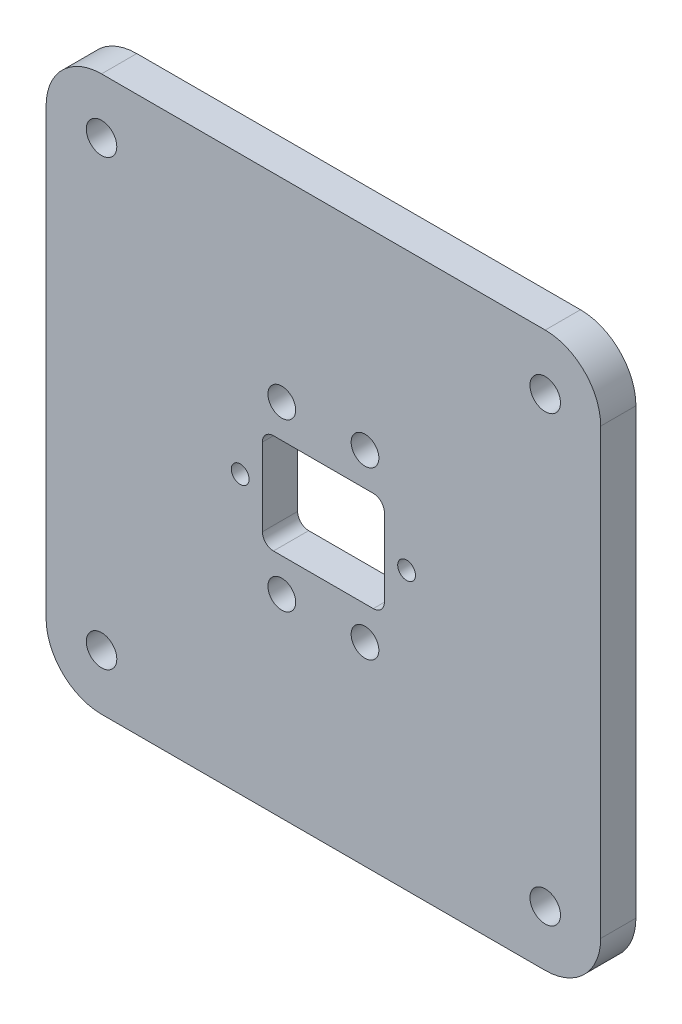
ISO-10303-21;
HEADER;
FILE_DESCRIPTION(('STEP AP214'),'2;1');
FILE_NAME('part.step','',(''),(''),'','','');
FILE_SCHEMA(('AUTOMOTIVE_DESIGN { 1 0 10303 214 1 1 1 1 }'));
ENDSEC;
DATA;
#1=APPLICATION_CONTEXT('core data for automotive mechanical design processes');
#2=APPLICATION_PROTOCOL_DEFINITION('international standard','automotive_design',2000,#1);
#3=PRODUCT_CONTEXT('',#1,'mechanical');
#4=PRODUCT('Part','Part','',(#3));
#5=PRODUCT_RELATED_PRODUCT_CATEGORY('part','',(#4));
#6=PRODUCT_DEFINITION_FORMATION('','',#4);
#7=PRODUCT_DEFINITION_CONTEXT('part definition',#1,'design');
#8=PRODUCT_DEFINITION('design','',#6,#7);
#9=PRODUCT_DEFINITION_SHAPE('','',#8);
#10=(LENGTH_UNIT() NAMED_UNIT(*) SI_UNIT(.MILLI.,.METRE.));
#11=(NAMED_UNIT(*) PLANE_ANGLE_UNIT() SI_UNIT($,.RADIAN.));
#12=(NAMED_UNIT(*) SI_UNIT($,.STERADIAN.) SOLID_ANGLE_UNIT());
#13=UNCERTAINTY_MEASURE_WITH_UNIT(LENGTH_MEASURE(1.E-05),#10,'distance_accuracy_value','');
#14=(GEOMETRIC_REPRESENTATION_CONTEXT(3) GLOBAL_UNCERTAINTY_ASSIGNED_CONTEXT((#13)) GLOBAL_UNIT_ASSIGNED_CONTEXT((#10,
#11,#12)) REPRESENTATION_CONTEXT('',''));
#15=CARTESIAN_POINT('',(0.,0.,0.));
#16=DIRECTION('',(0.,0.,1.));
#17=DIRECTION('',(1.,0.,0.));
#18=AXIS2_PLACEMENT_3D('',#15,#16,#17);
#19=CARTESIAN_POINT('',(40.,40.,6.35));
#20=DIRECTION('',(0.,0.,1.));
#21=DIRECTION('',(1.,0.,0.));
#22=AXIS2_PLACEMENT_3D('',#19,#20,#21);
#23=PLANE('',#22);
#24=CARTESIAN_POINT('',(-14.9999999999864,3.40474063403179E-12,6.35));
#25=DIRECTION('',(0.,0.,1.));
#26=DIRECTION('',(1.,0.,0.));
#27=AXIS2_PLACEMENT_3D('',#24,#25,#26);
#28=CIRCLE('',#27,1.59999999999901);
#29=CARTESIAN_POINT('',(-13.3999999999873,3.40474063403179E-12,6.35));
#30=VERTEX_POINT('',#29);
#31=EDGE_CURVE('E413',#30,#30,#28,.T.);
#32=ORIENTED_EDGE('',*,*,#31,.F.);
#33=EDGE_LOOP('',(#32));
#34=FACE_BOUND('',#33,.T.);
#35=CARTESIAN_POINT('',(7.50000000000001,-15.,6.35));
#36=DIRECTION('',(0.,0.,1.));
#37=DIRECTION('',(1.,0.,0.));
#38=AXIS2_PLACEMENT_3D('',#35,#36,#37);
#39=CIRCLE('',#38,2.5);
#40=CARTESIAN_POINT('',(10.,-15.,6.35));
#41=VERTEX_POINT('',#40);
#42=EDGE_CURVE('E425',#41,#41,#39,.T.);
#43=ORIENTED_EDGE('',*,*,#42,.F.);
#44=EDGE_LOOP('',(#43));
#45=FACE_BOUND('',#44,.T.);
#46=CARTESIAN_POINT('',(-7.49999999999999,15.,6.35));
#47=DIRECTION('',(0.,0.,1.));
#48=DIRECTION('',(1.,0.,0.));
#49=AXIS2_PLACEMENT_3D('',#46,#47,#48);
#50=CIRCLE('',#49,2.5);
#51=CARTESIAN_POINT('',(-4.99999999999999,15.,6.35));
#52=VERTEX_POINT('',#51);
#53=EDGE_CURVE('E437',#52,#52,#50,.T.);
#54=ORIENTED_EDGE('',*,*,#53,.F.);
#55=EDGE_LOOP('',(#54));
#56=FACE_BOUND('',#55,.T.);
#57=CARTESIAN_POINT('',(40.,-40.,6.35));
#58=DIRECTION('',(0.,0.,1.));
#59=DIRECTION('',(1.,0.,0.));
#60=AXIS2_PLACEMENT_3D('',#57,#58,#59);
#61=CIRCLE('',#60,2.75);
#62=CARTESIAN_POINT('',(42.75,-40.,6.35));
#63=VERTEX_POINT('',#62);
#64=EDGE_CURVE('E449',#63,#63,#61,.T.);
#65=ORIENTED_EDGE('',*,*,#64,.F.);
#66=EDGE_LOOP('',(#65));
#67=FACE_BOUND('',#66,.T.);
#68=CARTESIAN_POINT('',(-40.,40.,6.35));
#69=DIRECTION('',(0.,0.,1.));
#70=DIRECTION('',(1.,0.,0.));
#71=AXIS2_PLACEMENT_3D('',#68,#69,#70);
#72=CIRCLE('',#71,2.75);
#73=CARTESIAN_POINT('',(-37.25,40.,6.35));
#74=VERTEX_POINT('',#73);
#75=EDGE_CURVE('E184',#74,#74,#72,.T.);
#76=ORIENTED_EDGE('',*,*,#75,.F.);
#77=EDGE_LOOP('',(#76));
#78=FACE_BOUND('',#77,.T.);
#79=CARTESIAN_POINT('',(40.,40.,6.35));
#80=DIRECTION('',(0.,0.,1.));
#81=DIRECTION('',(1.,0.,0.));
#82=AXIS2_PLACEMENT_3D('',#79,#80,#81);
#83=CIRCLE('',#82,10.);
#84=CARTESIAN_POINT('',(50.,39.9999999999999,6.35));
#85=VERTEX_POINT('',#84);
#86=CARTESIAN_POINT('',(39.9999999999999,50.,6.35));
#87=VERTEX_POINT('',#86);
#88=EDGE_CURVE('E214',#85,#87,#83,.T.);
#89=ORIENTED_EDGE('',*,*,#88,.T.);
#90=DIRECTION('',(-1.,0.,0.));
#91=VECTOR('',#90,1.);
#92=CARTESIAN_POINT('',(39.9999999999999,50.,6.35));
#93=LINE('',#92,#91);
#94=CARTESIAN_POINT('',(-39.9999999999999,50.,6.35));
#95=VERTEX_POINT('',#94);
#96=EDGE_CURVE('E217',#87,#95,#93,.T.);
#97=ORIENTED_EDGE('',*,*,#96,.T.);
#98=CARTESIAN_POINT('',(-40.,40.,6.35));
#99=DIRECTION('',(0.,0.,1.));
#100=DIRECTION('',(1.,0.,0.));
#101=AXIS2_PLACEMENT_3D('',#98,#99,#100);
#102=CIRCLE('',#101,9.99999999999999);
#103=CARTESIAN_POINT('',(-50.,39.9999999999999,6.35));
#104=VERTEX_POINT('',#103);
#105=EDGE_CURVE('E220',#95,#104,#102,.T.);
#106=ORIENTED_EDGE('',*,*,#105,.T.);
#107=DIRECTION('',(0.,-1.,0.));
#108=VECTOR('',#107,1.);
#109=CARTESIAN_POINT('',(-50.,-40.,6.35));
#110=LINE('',#109,#108);
#111=CARTESIAN_POINT('',(-50.,-40.,6.35));
#112=VERTEX_POINT('',#111);
#113=EDGE_CURVE('E222',#104,#112,#110,.T.);
#114=ORIENTED_EDGE('',*,*,#113,.T.);
#115=CARTESIAN_POINT('',(-40.,-40.,6.35));
#116=DIRECTION('',(0.,0.,1.));
#117=DIRECTION('',(1.,0.,0.));
#118=AXIS2_PLACEMENT_3D('',#115,#116,#117);
#119=CIRCLE('',#118,10.);
#120=CARTESIAN_POINT('',(-39.9999999999999,-50.,6.35));
#121=VERTEX_POINT('',#120);
#122=EDGE_CURVE('E224',#112,#121,#119,.T.);
#123=ORIENTED_EDGE('',*,*,#122,.T.);
#124=DIRECTION('',(1.,0.,0.));
#125=VECTOR('',#124,1.);
#126=CARTESIAN_POINT('',(39.9999999999999,-50.,6.35));
#127=LINE('',#126,#125);
#128=CARTESIAN_POINT('',(39.9999999999999,-50.,6.35));
#129=VERTEX_POINT('',#128);
#130=EDGE_CURVE('E226',#121,#129,#127,.T.);
#131=ORIENTED_EDGE('',*,*,#130,.T.);
#132=CARTESIAN_POINT('',(40.,-40.,6.35));
#133=DIRECTION('',(0.,0.,1.));
#134=DIRECTION('',(1.,0.,0.));
#135=AXIS2_PLACEMENT_3D('',#132,#133,#134);
#136=CIRCLE('',#135,10.);
#137=CARTESIAN_POINT('',(50.,-39.9999999999999,6.35));
#138=VERTEX_POINT('',#137);
#139=EDGE_CURVE('E228',#129,#138,#136,.T.);
#140=ORIENTED_EDGE('',*,*,#139,.T.);
#141=DIRECTION('',(0.,1.,0.));
#142=VECTOR('',#141,1.);
#143=CARTESIAN_POINT('',(50.,-39.9999999999999,6.35));
#144=LINE('',#143,#142);
#145=EDGE_CURVE('E230',#138,#85,#144,.T.);
#146=ORIENTED_EDGE('',*,*,#145,.T.);
#147=EDGE_LOOP('',(#89,#97,#106,#114,#123,#131,#140,#146));
#148=FACE_BOUND('',#147,.T.);
#149=DIRECTION('',(1.,0.,0.));
#150=VECTOR('',#149,1.);
#151=CARTESIAN_POINT('',(9.,-9.,6.35));
#152=LINE('',#151,#150);
#153=CARTESIAN_POINT('',(-9.,-9.,6.35));
#154=VERTEX_POINT('',#153);
#155=CARTESIAN_POINT('',(9.,-9.,6.35));
#156=VERTEX_POINT('',#155);
#157=EDGE_CURVE('E154',#154,#156,#152,.T.);
#158=ORIENTED_EDGE('',*,*,#157,.F.);
#159=CARTESIAN_POINT('',(-9.,-7.,6.35));
#160=DIRECTION('',(0.,0.,1.));
#161=DIRECTION('',(1.,0.,0.));
#162=AXIS2_PLACEMENT_3D('',#159,#160,#161);
#163=CIRCLE('',#162,2.);
#164=CARTESIAN_POINT('',(-11.,-7.,6.35));
#165=VERTEX_POINT('',#164);
#166=EDGE_CURVE('E146',#165,#154,#163,.T.);
#167=ORIENTED_EDGE('',*,*,#166,.F.);
#168=DIRECTION('',(0.,-1.,0.));
#169=VECTOR('',#168,1.);
#170=CARTESIAN_POINT('',(-11.,-7.,6.35));
#171=LINE('',#170,#169);
#172=CARTESIAN_POINT('',(-11.,7.,6.35));
#173=VERTEX_POINT('',#172);
#174=EDGE_CURVE('E181',#173,#165,#171,.T.);
#175=ORIENTED_EDGE('',*,*,#174,.F.);
#176=CARTESIAN_POINT('',(-9.,7.,6.35));
#177=DIRECTION('',(0.,0.,1.));
#178=DIRECTION('',(1.,0.,0.));
#179=AXIS2_PLACEMENT_3D('',#176,#177,#178);
#180=CIRCLE('',#179,2.);
#181=CARTESIAN_POINT('',(-9.,9.,6.35));
#182=VERTEX_POINT('',#181);
#183=EDGE_CURVE('E179',#182,#173,#180,.T.);
#184=ORIENTED_EDGE('',*,*,#183,.F.);
#185=DIRECTION('',(-1.,0.,0.));
#186=VECTOR('',#185,1.);
#187=CARTESIAN_POINT('',(9.,9.,6.35));
#188=LINE('',#187,#186);
#189=CARTESIAN_POINT('',(9.,9.,6.35));
#190=VERTEX_POINT('',#189);
#191=EDGE_CURVE('E177',#190,#182,#188,.T.);
#192=ORIENTED_EDGE('',*,*,#191,.F.);
#193=CARTESIAN_POINT('',(9.,7.,6.35));
#194=DIRECTION('',(0.,0.,1.));
#195=DIRECTION('',(1.,0.,0.));
#196=AXIS2_PLACEMENT_3D('',#193,#194,#195);
#197=CIRCLE('',#196,2.);
#198=CARTESIAN_POINT('',(11.,7.,6.35));
#199=VERTEX_POINT('',#198);
#200=EDGE_CURVE('E175',#199,#190,#197,.T.);
#201=ORIENTED_EDGE('',*,*,#200,.F.);
#202=DIRECTION('',(0.,1.,0.));
#203=VECTOR('',#202,1.);
#204=CARTESIAN_POINT('',(11.,-7.,6.35));
#205=LINE('',#204,#203);
#206=CARTESIAN_POINT('',(11.,-7.,6.35));
#207=VERTEX_POINT('',#206);
#208=EDGE_CURVE('E170',#207,#199,#205,.T.);
#209=ORIENTED_EDGE('',*,*,#208,.F.);
#210=CARTESIAN_POINT('',(9.,-7.,6.35));
#211=DIRECTION('',(0.,0.,1.));
#212=DIRECTION('',(1.,0.,0.));
#213=AXIS2_PLACEMENT_3D('',#210,#211,#212);
#214=CIRCLE('',#213,2.);
#215=EDGE_CURVE('E168',#156,#207,#214,.T.);
#216=ORIENTED_EDGE('',*,*,#215,.F.);
#217=EDGE_LOOP('',(#158,#167,#175,#184,#192,#201,#209,#216));
#218=FACE_BOUND('',#217,.T.);
#219=CARTESIAN_POINT('',(40.,40.,6.35));
#220=DIRECTION('',(0.,0.,1.));
#221=DIRECTION('',(1.,0.,0.));
#222=AXIS2_PLACEMENT_3D('',#219,#220,#221);
#223=CIRCLE('',#222,2.75);
#224=CARTESIAN_POINT('',(42.75,40.,6.35));
#225=VERTEX_POINT('',#224);
#226=EDGE_CURVE('E455',#225,#225,#223,.T.);
#227=ORIENTED_EDGE('',*,*,#226,.F.);
#228=EDGE_LOOP('',(#227));
#229=FACE_BOUND('',#228,.T.);
#230=CARTESIAN_POINT('',(-40.,-40.,6.35));
#231=DIRECTION('',(0.,0.,1.));
#232=DIRECTION('',(1.,0.,0.));
#233=AXIS2_PLACEMENT_3D('',#230,#231,#232);
#234=CIRCLE('',#233,2.75);
#235=CARTESIAN_POINT('',(-37.25,-40.,6.35));
#236=VERTEX_POINT('',#235);
#237=EDGE_CURVE('E443',#236,#236,#234,.T.);
#238=ORIENTED_EDGE('',*,*,#237,.F.);
#239=EDGE_LOOP('',(#238));
#240=FACE_BOUND('',#239,.T.);
#241=CARTESIAN_POINT('',(7.50000000000001,15.,6.35));
#242=DIRECTION('',(0.,0.,1.));
#243=DIRECTION('',(1.,0.,0.));
#244=AXIS2_PLACEMENT_3D('',#241,#242,#243);
#245=CIRCLE('',#244,2.5);
#246=CARTESIAN_POINT('',(10.,15.,6.35));
#247=VERTEX_POINT('',#246);
#248=EDGE_CURVE('E431',#247,#247,#245,.T.);
#249=ORIENTED_EDGE('',*,*,#248,.F.);
#250=EDGE_LOOP('',(#249));
#251=FACE_BOUND('',#250,.T.);
#252=CARTESIAN_POINT('',(-7.49999999999999,-15.,6.35));
#253=DIRECTION('',(0.,0.,1.));
#254=DIRECTION('',(1.,0.,0.));
#255=AXIS2_PLACEMENT_3D('',#252,#253,#254);
#256=CIRCLE('',#255,2.5);
#257=CARTESIAN_POINT('',(-4.99999999999999,-15.,6.35));
#258=VERTEX_POINT('',#257);
#259=EDGE_CURVE('E419',#258,#258,#256,.T.);
#260=ORIENTED_EDGE('',*,*,#259,.F.);
#261=EDGE_LOOP('',(#260));
#262=FACE_BOUND('',#261,.T.);
#263=CARTESIAN_POINT('',(14.9999999999864,3.40841457442923E-12,6.35));
#264=DIRECTION('',(0.,0.,1.));
#265=DIRECTION('',(1.,0.,0.));
#266=AXIS2_PLACEMENT_3D('',#263,#264,#265);
#267=CIRCLE('',#266,1.599999999999);
#268=CARTESIAN_POINT('',(16.5999999999854,3.40841457442923E-12,6.35));
#269=VERTEX_POINT('',#268);
#270=EDGE_CURVE('E404',#269,#269,#267,.T.);
#271=ORIENTED_EDGE('',*,*,#270,.F.);
#272=EDGE_LOOP('',(#271));
#273=FACE_BOUND('',#272,.T.);
#274=ADVANCED_FACE('F33',(#34,#45,#56,#67,#78,#148,#218,#229,#240,#251,#262,#273),#23,.T.);
#275=CARTESIAN_POINT('',(40.,40.,0.));
#276=DIRECTION('',(0.,0.,1.));
#277=DIRECTION('',(1.,0.,0.));
#278=AXIS2_PLACEMENT_3D('',#275,#276,#277);
#279=PLANE('',#278);
#280=CARTESIAN_POINT('',(-14.9999999999864,3.40474063403179E-12,0.));
#281=DIRECTION('',(0.,0.,1.));
#282=DIRECTION('',(1.,0.,0.));
#283=AXIS2_PLACEMENT_3D('',#280,#281,#282);
#284=CIRCLE('',#283,1.59999999999901);
#285=CARTESIAN_POINT('',(-13.3999999999873,3.40474063403179E-12,0.));
#286=VERTEX_POINT('',#285);
#287=EDGE_CURVE('E410',#286,#286,#284,.T.);
#288=ORIENTED_EDGE('',*,*,#287,.T.);
#289=EDGE_LOOP('',(#288));
#290=FACE_BOUND('',#289,.T.);
#291=CARTESIAN_POINT('',(7.50000000000001,-15.,0.));
#292=DIRECTION('',(0.,0.,1.));
#293=DIRECTION('',(1.,0.,0.));
#294=AXIS2_PLACEMENT_3D('',#291,#292,#293);
#295=CIRCLE('',#294,2.5);
#296=CARTESIAN_POINT('',(10.,-15.,0.));
#297=VERTEX_POINT('',#296);
#298=EDGE_CURVE('E422',#297,#297,#295,.T.);
#299=ORIENTED_EDGE('',*,*,#298,.T.);
#300=EDGE_LOOP('',(#299));
#301=FACE_BOUND('',#300,.T.);
#302=CARTESIAN_POINT('',(-7.49999999999999,15.,0.));
#303=DIRECTION('',(0.,0.,1.));
#304=DIRECTION('',(1.,0.,0.));
#305=AXIS2_PLACEMENT_3D('',#302,#303,#304);
#306=CIRCLE('',#305,2.5);
#307=CARTESIAN_POINT('',(-4.99999999999999,15.,0.));
#308=VERTEX_POINT('',#307);
#309=EDGE_CURVE('E434',#308,#308,#306,.T.);
#310=ORIENTED_EDGE('',*,*,#309,.T.);
#311=EDGE_LOOP('',(#310));
#312=FACE_BOUND('',#311,.T.);
#313=CARTESIAN_POINT('',(40.,-40.,0.));
#314=DIRECTION('',(0.,0.,1.));
#315=DIRECTION('',(1.,0.,0.));
#316=AXIS2_PLACEMENT_3D('',#313,#314,#315);
#317=CIRCLE('',#316,2.75);
#318=CARTESIAN_POINT('',(42.75,-40.,0.));
#319=VERTEX_POINT('',#318);
#320=EDGE_CURVE('E446',#319,#319,#317,.T.);
#321=ORIENTED_EDGE('',*,*,#320,.T.);
#322=EDGE_LOOP('',(#321));
#323=FACE_BOUND('',#322,.T.);
#324=CARTESIAN_POINT('',(-40.,40.,0.));
#325=DIRECTION('',(0.,0.,1.));
#326=DIRECTION('',(1.,0.,0.));
#327=AXIS2_PLACEMENT_3D('',#324,#325,#326);
#328=CIRCLE('',#327,2.75);
#329=CARTESIAN_POINT('',(-37.25,40.,0.));
#330=VERTEX_POINT('',#329);
#331=EDGE_CURVE('E458',#330,#330,#328,.T.);
#332=ORIENTED_EDGE('',*,*,#331,.T.);
#333=EDGE_LOOP('',(#332));
#334=FACE_BOUND('',#333,.T.);
#335=CARTESIAN_POINT('',(40.,40.,0.));
#336=DIRECTION('',(0.,0.,1.));
#337=DIRECTION('',(1.,0.,0.));
#338=AXIS2_PLACEMENT_3D('',#335,#336,#337);
#339=CIRCLE('',#338,10.);
#340=CARTESIAN_POINT('',(50.,39.9999999999999,0.));
#341=VERTEX_POINT('',#340);
#342=CARTESIAN_POINT('',(39.9999999999999,50.,0.));
#343=VERTEX_POINT('',#342);
#344=EDGE_CURVE('E162',#341,#343,#339,.T.);
#345=ORIENTED_EDGE('',*,*,#344,.F.);
#346=DIRECTION('',(0.,1.,0.));
#347=VECTOR('',#346,1.);
#348=CARTESIAN_POINT('',(50.,-39.9999999999999,0.));
#349=LINE('',#348,#347);
#350=CARTESIAN_POINT('',(50.,-39.9999999999999,0.));
#351=VERTEX_POINT('',#350);
#352=EDGE_CURVE('E218',#351,#341,#349,.T.);
#353=ORIENTED_EDGE('',*,*,#352,.F.);
#354=CARTESIAN_POINT('',(40.,-40.,0.));
#355=DIRECTION('',(0.,0.,1.));
#356=DIRECTION('',(1.,0.,0.));
#357=AXIS2_PLACEMENT_3D('',#354,#355,#356);
#358=CIRCLE('',#357,10.);
#359=CARTESIAN_POINT('',(39.9999999999999,-50.,0.));
#360=VERTEX_POINT('',#359);
#361=EDGE_CURVE('E245',#360,#351,#358,.T.);
#362=ORIENTED_EDGE('',*,*,#361,.F.);
#363=DIRECTION('',(1.,0.,0.));
#364=VECTOR('',#363,1.);
#365=CARTESIAN_POINT('',(39.9999999999999,-50.,0.));
#366=LINE('',#365,#364);
#367=CARTESIAN_POINT('',(-39.9999999999999,-50.,0.));
#368=VERTEX_POINT('',#367);
#369=EDGE_CURVE('E243',#368,#360,#366,.T.);
#370=ORIENTED_EDGE('',*,*,#369,.F.);
#371=CARTESIAN_POINT('',(-40.,-40.,0.));
#372=DIRECTION('',(0.,0.,1.));
#373=DIRECTION('',(1.,0.,0.));
#374=AXIS2_PLACEMENT_3D('',#371,#372,#373);
#375=CIRCLE('',#374,10.);
#376=CARTESIAN_POINT('',(-50.,-40.,0.));
#377=VERTEX_POINT('',#376);
#378=EDGE_CURVE('E241',#377,#368,#375,.T.);
#379=ORIENTED_EDGE('',*,*,#378,.F.);
#380=DIRECTION('',(0.,-1.,0.));
#381=VECTOR('',#380,1.);
#382=CARTESIAN_POINT('',(-50.,-40.,0.));
#383=LINE('',#382,#381);
#384=CARTESIAN_POINT('',(-50.,39.9999999999999,0.));
#385=VERTEX_POINT('',#384);
#386=EDGE_CURVE('E239',#385,#377,#383,.T.);
#387=ORIENTED_EDGE('',*,*,#386,.F.);
#388=CARTESIAN_POINT('',(-40.,40.,0.));
#389=DIRECTION('',(0.,0.,1.));
#390=DIRECTION('',(1.,0.,0.));
#391=AXIS2_PLACEMENT_3D('',#388,#389,#390);
#392=CIRCLE('',#391,9.99999999999999);
#393=CARTESIAN_POINT('',(-39.9999999999999,50.,0.));
#394=VERTEX_POINT('',#393);
#395=EDGE_CURVE('E237',#394,#385,#392,.T.);
#396=ORIENTED_EDGE('',*,*,#395,.F.);
#397=DIRECTION('',(-1.,0.,0.));
#398=VECTOR('',#397,1.);
#399=CARTESIAN_POINT('',(39.9999999999999,50.,0.));
#400=LINE('',#399,#398);
#401=EDGE_CURVE('E235',#343,#394,#400,.T.);
#402=ORIENTED_EDGE('',*,*,#401,.F.);
#403=EDGE_LOOP('',(#345,#353,#362,#370,#379,#387,#396,#402));
#404=FACE_BOUND('',#403,.T.);
#405=CARTESIAN_POINT('',(-9.,-7.,0.));
#406=DIRECTION('',(0.,0.,1.));
#407=DIRECTION('',(1.,0.,0.));
#408=AXIS2_PLACEMENT_3D('',#405,#406,#407);
#409=CIRCLE('',#408,2.);
#410=CARTESIAN_POINT('',(-11.,-7.,0.));
#411=VERTEX_POINT('',#410);
#412=CARTESIAN_POINT('',(-9.,-9.,0.));
#413=VERTEX_POINT('',#412);
#414=EDGE_CURVE('E56',#411,#413,#409,.T.);
#415=ORIENTED_EDGE('',*,*,#414,.T.);
#416=DIRECTION('',(1.,0.,0.));
#417=VECTOR('',#416,1.);
#418=CARTESIAN_POINT('',(9.,-9.,0.));
#419=LINE('',#418,#417);
#420=CARTESIAN_POINT('',(9.,-9.,0.));
#421=VERTEX_POINT('',#420);
#422=EDGE_CURVE('E161',#413,#421,#419,.T.);
#423=ORIENTED_EDGE('',*,*,#422,.T.);
#424=CARTESIAN_POINT('',(9.,-7.,0.));
#425=DIRECTION('',(0.,0.,1.));
#426=DIRECTION('',(1.,0.,0.));
#427=AXIS2_PLACEMENT_3D('',#424,#425,#426);
#428=CIRCLE('',#427,2.);
#429=CARTESIAN_POINT('',(11.,-7.,0.));
#430=VERTEX_POINT('',#429);
#431=EDGE_CURVE('E186',#421,#430,#428,.T.);
#432=ORIENTED_EDGE('',*,*,#431,.T.);
#433=DIRECTION('',(0.,1.,0.));
#434=VECTOR('',#433,1.);
#435=CARTESIAN_POINT('',(11.,-7.,0.));
#436=LINE('',#435,#434);
#437=CARTESIAN_POINT('',(11.,7.,0.));
#438=VERTEX_POINT('',#437);
#439=EDGE_CURVE('E189',#430,#438,#436,.T.);
#440=ORIENTED_EDGE('',*,*,#439,.T.);
#441=CARTESIAN_POINT('',(9.,7.,0.));
#442=DIRECTION('',(0.,0.,1.));
#443=DIRECTION('',(1.,0.,0.));
#444=AXIS2_PLACEMENT_3D('',#441,#442,#443);
#445=CIRCLE('',#444,2.);
#446=CARTESIAN_POINT('',(9.,9.,0.));
#447=VERTEX_POINT('',#446);
#448=EDGE_CURVE('E192',#438,#447,#445,.T.);
#449=ORIENTED_EDGE('',*,*,#448,.T.);
#450=DIRECTION('',(-1.,0.,0.));
#451=VECTOR('',#450,1.);
#452=CARTESIAN_POINT('',(9.,9.,0.));
#453=LINE('',#452,#451);
#454=CARTESIAN_POINT('',(-9.,9.,0.));
#455=VERTEX_POINT('',#454);
#456=EDGE_CURVE('E195',#447,#455,#453,.T.);
#457=ORIENTED_EDGE('',*,*,#456,.T.);
#458=CARTESIAN_POINT('',(-9.,7.,0.));
#459=DIRECTION('',(0.,0.,1.));
#460=DIRECTION('',(1.,0.,0.));
#461=AXIS2_PLACEMENT_3D('',#458,#459,#460);
#462=CIRCLE('',#461,2.);
#463=CARTESIAN_POINT('',(-11.,7.,0.));
#464=VERTEX_POINT('',#463);
#465=EDGE_CURVE('E198',#455,#464,#462,.T.);
#466=ORIENTED_EDGE('',*,*,#465,.T.);
#467=DIRECTION('',(0.,-1.,0.));
#468=VECTOR('',#467,1.);
#469=CARTESIAN_POINT('',(-11.,-7.,0.));
#470=LINE('',#469,#468);
#471=EDGE_CURVE('E155',#464,#411,#470,.T.);
#472=ORIENTED_EDGE('',*,*,#471,.T.);
#473=EDGE_LOOP('',(#415,#423,#432,#440,#449,#457,#466,#472));
#474=FACE_BOUND('',#473,.T.);
#475=CARTESIAN_POINT('',(40.,40.,0.));
#476=DIRECTION('',(0.,0.,1.));
#477=DIRECTION('',(1.,0.,0.));
#478=AXIS2_PLACEMENT_3D('',#475,#476,#477);
#479=CIRCLE('',#478,2.75);
#480=CARTESIAN_POINT('',(42.75,40.,0.));
#481=VERTEX_POINT('',#480);
#482=EDGE_CURVE('E452',#481,#481,#479,.T.);
#483=ORIENTED_EDGE('',*,*,#482,.T.);
#484=EDGE_LOOP('',(#483));
#485=FACE_BOUND('',#484,.T.);
#486=CARTESIAN_POINT('',(-40.,-40.,0.));
#487=DIRECTION('',(0.,0.,1.));
#488=DIRECTION('',(1.,0.,0.));
#489=AXIS2_PLACEMENT_3D('',#486,#487,#488);
#490=CIRCLE('',#489,2.75);
#491=CARTESIAN_POINT('',(-37.25,-40.,0.));
#492=VERTEX_POINT('',#491);
#493=EDGE_CURVE('E440',#492,#492,#490,.T.);
#494=ORIENTED_EDGE('',*,*,#493,.T.);
#495=EDGE_LOOP('',(#494));
#496=FACE_BOUND('',#495,.T.);
#497=CARTESIAN_POINT('',(7.50000000000001,15.,0.));
#498=DIRECTION('',(0.,0.,1.));
#499=DIRECTION('',(1.,0.,0.));
#500=AXIS2_PLACEMENT_3D('',#497,#498,#499);
#501=CIRCLE('',#500,2.5);
#502=CARTESIAN_POINT('',(10.,15.,0.));
#503=VERTEX_POINT('',#502);
#504=EDGE_CURVE('E428',#503,#503,#501,.T.);
#505=ORIENTED_EDGE('',*,*,#504,.T.);
#506=EDGE_LOOP('',(#505));
#507=FACE_BOUND('',#506,.T.);
#508=CARTESIAN_POINT('',(-7.49999999999999,-15.,0.));
#509=DIRECTION('',(0.,0.,1.));
#510=DIRECTION('',(1.,0.,0.));
#511=AXIS2_PLACEMENT_3D('',#508,#509,#510);
#512=CIRCLE('',#511,2.5);
#513=CARTESIAN_POINT('',(-4.99999999999999,-15.,0.));
#514=VERTEX_POINT('',#513);
#515=EDGE_CURVE('E416',#514,#514,#512,.T.);
#516=ORIENTED_EDGE('',*,*,#515,.T.);
#517=EDGE_LOOP('',(#516));
#518=FACE_BOUND('',#517,.T.);
#519=CARTESIAN_POINT('',(14.9999999999864,3.40841457442923E-12,0.));
#520=DIRECTION('',(0.,0.,1.));
#521=DIRECTION('',(1.,0.,0.));
#522=AXIS2_PLACEMENT_3D('',#519,#520,#521);
#523=CIRCLE('',#522,1.599999999999);
#524=CARTESIAN_POINT('',(16.5999999999854,3.40841457442923E-12,0.));
#525=VERTEX_POINT('',#524);
#526=EDGE_CURVE('E407',#525,#525,#523,.T.);
#527=ORIENTED_EDGE('',*,*,#526,.T.);
#528=EDGE_LOOP('',(#527));
#529=FACE_BOUND('',#528,.T.);
#530=ADVANCED_FACE('F275',(#290,#301,#312,#323,#334,#404,#474,#485,#496,#507,#518,#529),#279,.F.);
#531=CARTESIAN_POINT('',(40.,40.,6.35));
#532=DIRECTION('',(0.,0.,-1.));
#533=DIRECTION('',(-1.,0.,0.));
#534=AXIS2_PLACEMENT_3D('',#531,#532,#533);
#535=CYLINDRICAL_SURFACE('',#534,10.);
#536=ORIENTED_EDGE('',*,*,#344,.T.);
#537=DIRECTION('',(0.,0.,-1.));
#538=VECTOR('',#537,1.);
#539=CARTESIAN_POINT('',(39.9999999999999,50.,6.35));
#540=LINE('',#539,#538);
#541=EDGE_CURVE('E11',#87,#343,#540,.T.);
#542=ORIENTED_EDGE('',*,*,#541,.F.);
#543=ORIENTED_EDGE('',*,*,#88,.F.);
#544=DIRECTION('',(0.,0.,-1.));
#545=VECTOR('',#544,1.);
#546=CARTESIAN_POINT('',(50.,39.9999999999999,6.35));
#547=LINE('',#546,#545);
#548=EDGE_CURVE('E232',#85,#341,#547,.T.);
#549=ORIENTED_EDGE('',*,*,#548,.T.);
#550=EDGE_LOOP('',(#536,#542,#543,#549));
#551=FACE_BOUND('',#550,.T.);
#552=ADVANCED_FACE('F35',(#551),#535,.T.);
#553=CARTESIAN_POINT('',(39.9999999999999,50.,6.35));
#554=DIRECTION('',(0.,-1.,0.));
#555=DIRECTION('',(1.,0.,0.));
#556=AXIS2_PLACEMENT_3D('',#553,#554,#555);
#557=PLANE('',#556);
#558=ORIENTED_EDGE('',*,*,#401,.T.);
#559=DIRECTION('',(0.,0.,-1.));
#560=VECTOR('',#559,1.);
#561=CARTESIAN_POINT('',(-39.9999999999999,50.,6.35));
#562=LINE('',#561,#560);
#563=EDGE_CURVE('E41',#95,#394,#562,.T.);
#564=ORIENTED_EDGE('',*,*,#563,.F.);
#565=ORIENTED_EDGE('',*,*,#96,.F.);
#566=ORIENTED_EDGE('',*,*,#541,.T.);
#567=EDGE_LOOP('',(#558,#564,#565,#566));
#568=FACE_BOUND('',#567,.T.);
#569=ADVANCED_FACE('F292',(#568),#557,.F.);
#570=CARTESIAN_POINT('',(-40.,40.,6.35));
#571=DIRECTION('',(0.,0.,-1.));
#572=DIRECTION('',(-1.,0.,0.));
#573=AXIS2_PLACEMENT_3D('',#570,#571,#572);
#574=CYLINDRICAL_SURFACE('',#573,9.99999999999999);
#575=ORIENTED_EDGE('',*,*,#395,.T.);
#576=DIRECTION('',(0.,0.,-1.));
#577=VECTOR('',#576,1.);
#578=CARTESIAN_POINT('',(-50.,39.9999999999999,6.35));
#579=LINE('',#578,#577);
#580=EDGE_CURVE('E262',#104,#385,#579,.T.);
#581=ORIENTED_EDGE('',*,*,#580,.F.);
#582=ORIENTED_EDGE('',*,*,#105,.F.);
#583=ORIENTED_EDGE('',*,*,#563,.T.);
#584=EDGE_LOOP('',(#575,#581,#582,#583));
#585=FACE_BOUND('',#584,.T.);
#586=ADVANCED_FACE('F269',(#585),#574,.T.);
#587=CARTESIAN_POINT('',(-50.,-40.,6.35));
#588=DIRECTION('',(1.,0.,0.));
#589=DIRECTION('',(0.,0.,-1.));
#590=AXIS2_PLACEMENT_3D('',#587,#588,#589);
#591=PLANE('',#590);
#592=ORIENTED_EDGE('',*,*,#386,.T.);
#593=DIRECTION('',(0.,0.,-1.));
#594=VECTOR('',#593,1.);
#595=CARTESIAN_POINT('',(-50.,-40.,6.35));
#596=LINE('',#595,#594);
#597=EDGE_CURVE('E259',#112,#377,#596,.T.);
#598=ORIENTED_EDGE('',*,*,#597,.F.);
#599=ORIENTED_EDGE('',*,*,#113,.F.);
#600=ORIENTED_EDGE('',*,*,#580,.T.);
#601=EDGE_LOOP('',(#592,#598,#599,#600));
#602=FACE_BOUND('',#601,.T.);
#603=ADVANCED_FACE('F281',(#602),#591,.F.);
#604=CARTESIAN_POINT('',(-40.,-40.,6.35));
#605=DIRECTION('',(0.,0.,-1.));
#606=DIRECTION('',(-1.,0.,0.));
#607=AXIS2_PLACEMENT_3D('',#604,#605,#606);
#608=CYLINDRICAL_SURFACE('',#607,10.);
#609=ORIENTED_EDGE('',*,*,#378,.T.);
#610=DIRECTION('',(0.,0.,-1.));
#611=VECTOR('',#610,1.);
#612=CARTESIAN_POINT('',(-39.9999999999999,-50.,6.35));
#613=LINE('',#612,#611);
#614=EDGE_CURVE('E256',#121,#368,#613,.T.);
#615=ORIENTED_EDGE('',*,*,#614,.F.);
#616=ORIENTED_EDGE('',*,*,#122,.F.);
#617=ORIENTED_EDGE('',*,*,#597,.T.);
#618=EDGE_LOOP('',(#609,#615,#616,#617));
#619=FACE_BOUND('',#618,.T.);
#620=ADVANCED_FACE('F285',(#619),#608,.T.);
#621=CARTESIAN_POINT('',(39.9999999999999,-50.,6.35));
#622=DIRECTION('',(0.,1.,0.));
#623=DIRECTION('',(-1.,0.,0.));
#624=AXIS2_PLACEMENT_3D('',#621,#622,#623);
#625=PLANE('',#624);
#626=ORIENTED_EDGE('',*,*,#369,.T.);
#627=DIRECTION('',(0.,0.,-1.));
#628=VECTOR('',#627,1.);
#629=CARTESIAN_POINT('',(39.9999999999999,-50.,6.35));
#630=LINE('',#629,#628);
#631=EDGE_CURVE('E253',#129,#360,#630,.T.);
#632=ORIENTED_EDGE('',*,*,#631,.F.);
#633=ORIENTED_EDGE('',*,*,#130,.F.);
#634=ORIENTED_EDGE('',*,*,#614,.T.);
#635=EDGE_LOOP('',(#626,#632,#633,#634));
#636=FACE_BOUND('',#635,.T.);
#637=ADVANCED_FACE('F305',(#636),#625,.F.);
#638=CARTESIAN_POINT('',(40.,-40.,6.35));
#639=DIRECTION('',(0.,0.,-1.));
#640=DIRECTION('',(-1.,0.,0.));
#641=AXIS2_PLACEMENT_3D('',#638,#639,#640);
#642=CYLINDRICAL_SURFACE('',#641,10.);
#643=ORIENTED_EDGE('',*,*,#361,.T.);
#644=DIRECTION('',(0.,0.,-1.));
#645=VECTOR('',#644,1.);
#646=CARTESIAN_POINT('',(50.,-39.9999999999999,6.35));
#647=LINE('',#646,#645);
#648=EDGE_CURVE('E250',#138,#351,#647,.T.);
#649=ORIENTED_EDGE('',*,*,#648,.F.);
#650=ORIENTED_EDGE('',*,*,#139,.F.);
#651=ORIENTED_EDGE('',*,*,#631,.T.);
#652=EDGE_LOOP('',(#643,#649,#650,#651));
#653=FACE_BOUND('',#652,.T.);
#654=ADVANCED_FACE('F303',(#653),#642,.T.);
#655=CARTESIAN_POINT('',(50.,-39.9999999999999,6.35));
#656=DIRECTION('',(-1.,0.,0.));
#657=DIRECTION('',(0.,0.,1.));
#658=AXIS2_PLACEMENT_3D('',#655,#656,#657);
#659=PLANE('',#658);
#660=ORIENTED_EDGE('',*,*,#352,.T.);
#661=ORIENTED_EDGE('',*,*,#548,.F.);
#662=ORIENTED_EDGE('',*,*,#145,.F.);
#663=ORIENTED_EDGE('',*,*,#648,.T.);
#664=EDGE_LOOP('',(#660,#661,#662,#663));
#665=FACE_BOUND('',#664,.T.);
#666=ADVANCED_FACE('F298',(#665),#659,.F.);
#667=CARTESIAN_POINT('',(-9.,-7.,6.35));
#668=DIRECTION('',(0.,0.,-1.));
#669=DIRECTION('',(-1.,0.,0.));
#670=AXIS2_PLACEMENT_3D('',#667,#668,#669);
#671=CYLINDRICAL_SURFACE('',#670,2.);
#672=ORIENTED_EDGE('',*,*,#414,.F.);
#673=DIRECTION('',(0.,0.,-1.));
#674=VECTOR('',#673,1.);
#675=CARTESIAN_POINT('',(-11.,-7.,6.35));
#676=LINE('',#675,#674);
#677=EDGE_CURVE('E150',#165,#411,#676,.T.);
#678=ORIENTED_EDGE('',*,*,#677,.F.);
#679=ORIENTED_EDGE('',*,*,#166,.T.);
#680=DIRECTION('',(0.,0.,-1.));
#681=VECTOR('',#680,1.);
#682=CARTESIAN_POINT('',(-9.,-9.,6.35));
#683=LINE('',#682,#681);
#684=EDGE_CURVE('E149',#154,#413,#683,.T.);
#685=ORIENTED_EDGE('',*,*,#684,.T.);
#686=EDGE_LOOP('',(#672,#678,#679,#685));
#687=FACE_BOUND('',#686,.T.);
#688=ADVANCED_FACE('F148',(#687),#671,.F.);
#689=CARTESIAN_POINT('',(9.,-9.,6.35));
#690=DIRECTION('',(0.,1.,0.));
#691=DIRECTION('',(-1.,0.,0.));
#692=AXIS2_PLACEMENT_3D('',#689,#690,#691);
#693=PLANE('',#692);
#694=ORIENTED_EDGE('',*,*,#422,.F.);
#695=ORIENTED_EDGE('',*,*,#684,.F.);
#696=ORIENTED_EDGE('',*,*,#157,.T.);
#697=DIRECTION('',(0.,0.,-1.));
#698=VECTOR('',#697,1.);
#699=CARTESIAN_POINT('',(9.,-9.,6.35));
#700=LINE('',#699,#698);
#701=EDGE_CURVE('E163',#156,#421,#700,.T.);
#702=ORIENTED_EDGE('',*,*,#701,.T.);
#703=EDGE_LOOP('',(#694,#695,#696,#702));
#704=FACE_BOUND('',#703,.T.);
#705=ADVANCED_FACE('F158',(#704),#693,.T.);
#706=CARTESIAN_POINT('',(9.,-7.,6.35));
#707=DIRECTION('',(0.,0.,-1.));
#708=DIRECTION('',(-1.,0.,0.));
#709=AXIS2_PLACEMENT_3D('',#706,#707,#708);
#710=CYLINDRICAL_SURFACE('',#709,2.);
#711=ORIENTED_EDGE('',*,*,#431,.F.);
#712=ORIENTED_EDGE('',*,*,#701,.F.);
#713=ORIENTED_EDGE('',*,*,#215,.T.);
#714=DIRECTION('',(0.,0.,-1.));
#715=VECTOR('',#714,1.);
#716=CARTESIAN_POINT('',(11.,-7.,6.35));
#717=LINE('',#716,#715);
#718=EDGE_CURVE('E211',#207,#430,#717,.T.);
#719=ORIENTED_EDGE('',*,*,#718,.T.);
#720=EDGE_LOOP('',(#711,#712,#713,#719));
#721=FACE_BOUND('',#720,.T.);
#722=ADVANCED_FACE('F334',(#721),#710,.F.);
#723=CARTESIAN_POINT('',(11.,-7.,6.35));
#724=DIRECTION('',(-1.,0.,0.));
#725=DIRECTION('',(0.,0.,1.));
#726=AXIS2_PLACEMENT_3D('',#723,#724,#725);
#727=PLANE('',#726);
#728=ORIENTED_EDGE('',*,*,#439,.F.);
#729=ORIENTED_EDGE('',*,*,#718,.F.);
#730=ORIENTED_EDGE('',*,*,#208,.T.);
#731=DIRECTION('',(0.,0.,-1.));
#732=VECTOR('',#731,1.);
#733=CARTESIAN_POINT('',(11.,7.,6.35));
#734=LINE('',#733,#732);
#735=EDGE_CURVE('E209',#199,#438,#734,.T.);
#736=ORIENTED_EDGE('',*,*,#735,.T.);
#737=EDGE_LOOP('',(#728,#729,#730,#736));
#738=FACE_BOUND('',#737,.T.);
#739=ADVANCED_FACE('F338',(#738),#727,.T.);
#740=CARTESIAN_POINT('',(9.,7.,6.35));
#741=DIRECTION('',(0.,0.,-1.));
#742=DIRECTION('',(-1.,0.,0.));
#743=AXIS2_PLACEMENT_3D('',#740,#741,#742);
#744=CYLINDRICAL_SURFACE('',#743,2.);
#745=ORIENTED_EDGE('',*,*,#448,.F.);
#746=ORIENTED_EDGE('',*,*,#735,.F.);
#747=ORIENTED_EDGE('',*,*,#200,.T.);
#748=DIRECTION('',(0.,0.,-1.));
#749=VECTOR('',#748,1.);
#750=CARTESIAN_POINT('',(9.,9.,6.35));
#751=LINE('',#750,#749);
#752=EDGE_CURVE('E207',#190,#447,#751,.T.);
#753=ORIENTED_EDGE('',*,*,#752,.T.);
#754=EDGE_LOOP('',(#745,#746,#747,#753));
#755=FACE_BOUND('',#754,.T.);
#756=ADVANCED_FACE('F344',(#755),#744,.F.);
#757=CARTESIAN_POINT('',(9.,9.,6.35));
#758=DIRECTION('',(0.,-1.,0.));
#759=DIRECTION('',(1.,0.,0.));
#760=AXIS2_PLACEMENT_3D('',#757,#758,#759);
#761=PLANE('',#760);
#762=ORIENTED_EDGE('',*,*,#456,.F.);
#763=ORIENTED_EDGE('',*,*,#752,.F.);
#764=ORIENTED_EDGE('',*,*,#191,.T.);
#765=DIRECTION('',(0.,0.,-1.));
#766=VECTOR('',#765,1.);
#767=CARTESIAN_POINT('',(-9.,9.,6.35));
#768=LINE('',#767,#766);
#769=EDGE_CURVE('E205',#182,#455,#768,.T.);
#770=ORIENTED_EDGE('',*,*,#769,.T.);
#771=EDGE_LOOP('',(#762,#763,#764,#770));
#772=FACE_BOUND('',#771,.T.);
#773=ADVANCED_FACE('F348',(#772),#761,.T.);
#774=CARTESIAN_POINT('',(-9.,7.,6.35));
#775=DIRECTION('',(0.,0.,-1.));
#776=DIRECTION('',(-1.,0.,0.));
#777=AXIS2_PLACEMENT_3D('',#774,#775,#776);
#778=CYLINDRICAL_SURFACE('',#777,2.);
#779=ORIENTED_EDGE('',*,*,#465,.F.);
#780=ORIENTED_EDGE('',*,*,#769,.F.);
#781=ORIENTED_EDGE('',*,*,#183,.T.);
#782=DIRECTION('',(0.,0.,-1.));
#783=VECTOR('',#782,1.);
#784=CARTESIAN_POINT('',(-11.,7.,6.35));
#785=LINE('',#784,#783);
#786=EDGE_CURVE('E48',#173,#464,#785,.T.);
#787=ORIENTED_EDGE('',*,*,#786,.T.);
#788=EDGE_LOOP('',(#779,#780,#781,#787));
#789=FACE_BOUND('',#788,.T.);
#790=ADVANCED_FACE('F352',(#789),#778,.F.);
#791=CARTESIAN_POINT('',(-11.,-7.,6.35));
#792=DIRECTION('',(1.,0.,0.));
#793=DIRECTION('',(0.,1.,0.));
#794=AXIS2_PLACEMENT_3D('',#791,#792,#793);
#795=PLANE('',#794);
#796=ORIENTED_EDGE('',*,*,#471,.F.);
#797=ORIENTED_EDGE('',*,*,#786,.F.);
#798=ORIENTED_EDGE('',*,*,#174,.T.);
#799=ORIENTED_EDGE('',*,*,#677,.T.);
#800=EDGE_LOOP('',(#796,#797,#798,#799));
#801=FACE_BOUND('',#800,.T.);
#802=ADVANCED_FACE('F356',(#801),#795,.T.);
#803=CARTESIAN_POINT('',(-40.,40.,6.35));
#804=DIRECTION('',(0.,0.,-1.));
#805=DIRECTION('',(-1.,0.,0.));
#806=AXIS2_PLACEMENT_3D('',#803,#804,#805);
#807=CYLINDRICAL_SURFACE('',#806,2.75);
#808=ORIENTED_EDGE('',*,*,#75,.T.);
#809=EDGE_LOOP('',(#808));
#810=FACE_BOUND('',#809,.T.);
#811=ORIENTED_EDGE('',*,*,#331,.F.);
#812=EDGE_LOOP('',(#811));
#813=FACE_BOUND('',#812,.T.);
#814=ADVANCED_FACE('F360',(#810,#813),#807,.F.);
#815=CARTESIAN_POINT('',(40.,40.,6.35));
#816=DIRECTION('',(0.,0.,-1.));
#817=DIRECTION('',(-1.,0.,0.));
#818=AXIS2_PLACEMENT_3D('',#815,#816,#817);
#819=CYLINDRICAL_SURFACE('',#818,2.75);
#820=ORIENTED_EDGE('',*,*,#226,.T.);
#821=EDGE_LOOP('',(#820));
#822=FACE_BOUND('',#821,.T.);
#823=ORIENTED_EDGE('',*,*,#482,.F.);
#824=EDGE_LOOP('',(#823));
#825=FACE_BOUND('',#824,.T.);
#826=ADVANCED_FACE('F363',(#822,#825),#819,.F.);
#827=CARTESIAN_POINT('',(40.,-40.,6.35));
#828=DIRECTION('',(0.,0.,-1.));
#829=DIRECTION('',(-1.,0.,0.));
#830=AXIS2_PLACEMENT_3D('',#827,#828,#829);
#831=CYLINDRICAL_SURFACE('',#830,2.75);
#832=ORIENTED_EDGE('',*,*,#64,.T.);
#833=EDGE_LOOP('',(#832));
#834=FACE_BOUND('',#833,.T.);
#835=ORIENTED_EDGE('',*,*,#320,.F.);
#836=EDGE_LOOP('',(#835));
#837=FACE_BOUND('',#836,.T.);
#838=ADVANCED_FACE('F367',(#834,#837),#831,.F.);
#839=CARTESIAN_POINT('',(-40.,-40.,6.35));
#840=DIRECTION('',(0.,0.,-1.));
#841=DIRECTION('',(-1.,0.,0.));
#842=AXIS2_PLACEMENT_3D('',#839,#840,#841);
#843=CYLINDRICAL_SURFACE('',#842,2.75);
#844=ORIENTED_EDGE('',*,*,#237,.T.);
#845=EDGE_LOOP('',(#844));
#846=FACE_BOUND('',#845,.T.);
#847=ORIENTED_EDGE('',*,*,#493,.F.);
#848=EDGE_LOOP('',(#847));
#849=FACE_BOUND('',#848,.T.);
#850=ADVANCED_FACE('F371',(#846,#849),#843,.F.);
#851=CARTESIAN_POINT('',(-7.49999999999999,15.,6.35));
#852=DIRECTION('',(0.,0.,-1.));
#853=DIRECTION('',(-1.,0.,0.));
#854=AXIS2_PLACEMENT_3D('',#851,#852,#853);
#855=CYLINDRICAL_SURFACE('',#854,2.5);
#856=ORIENTED_EDGE('',*,*,#53,.T.);
#857=EDGE_LOOP('',(#856));
#858=FACE_BOUND('',#857,.T.);
#859=ORIENTED_EDGE('',*,*,#309,.F.);
#860=EDGE_LOOP('',(#859));
#861=FACE_BOUND('',#860,.T.);
#862=ADVANCED_FACE('F375',(#858,#861),#855,.F.);
#863=CARTESIAN_POINT('',(7.50000000000001,15.,6.35));
#864=DIRECTION('',(0.,0.,-1.));
#865=DIRECTION('',(-1.,0.,0.));
#866=AXIS2_PLACEMENT_3D('',#863,#864,#865);
#867=CYLINDRICAL_SURFACE('',#866,2.5);
#868=ORIENTED_EDGE('',*,*,#248,.T.);
#869=EDGE_LOOP('',(#868));
#870=FACE_BOUND('',#869,.T.);
#871=ORIENTED_EDGE('',*,*,#504,.F.);
#872=EDGE_LOOP('',(#871));
#873=FACE_BOUND('',#872,.T.);
#874=ADVANCED_FACE('F379',(#870,#873),#867,.F.);
#875=CARTESIAN_POINT('',(7.50000000000001,-15.,6.35));
#876=DIRECTION('',(0.,0.,-1.));
#877=DIRECTION('',(-1.,0.,0.));
#878=AXIS2_PLACEMENT_3D('',#875,#876,#877);
#879=CYLINDRICAL_SURFACE('',#878,2.5);
#880=ORIENTED_EDGE('',*,*,#42,.T.);
#881=EDGE_LOOP('',(#880));
#882=FACE_BOUND('',#881,.T.);
#883=ORIENTED_EDGE('',*,*,#298,.F.);
#884=EDGE_LOOP('',(#883));
#885=FACE_BOUND('',#884,.T.);
#886=ADVANCED_FACE('F383',(#882,#885),#879,.F.);
#887=CARTESIAN_POINT('',(-7.49999999999999,-15.,6.35));
#888=DIRECTION('',(0.,0.,-1.));
#889=DIRECTION('',(-1.,0.,0.));
#890=AXIS2_PLACEMENT_3D('',#887,#888,#889);
#891=CYLINDRICAL_SURFACE('',#890,2.5);
#892=ORIENTED_EDGE('',*,*,#259,.T.);
#893=EDGE_LOOP('',(#892));
#894=FACE_BOUND('',#893,.T.);
#895=ORIENTED_EDGE('',*,*,#515,.F.);
#896=EDGE_LOOP('',(#895));
#897=FACE_BOUND('',#896,.T.);
#898=ADVANCED_FACE('F387',(#894,#897),#891,.F.);
#899=CARTESIAN_POINT('',(-14.9999999999864,3.40474063403179E-12,6.35));
#900=DIRECTION('',(0.,0.,-1.));
#901=DIRECTION('',(-1.,0.,0.));
#902=AXIS2_PLACEMENT_3D('',#899,#900,#901);
#903=CYLINDRICAL_SURFACE('',#902,1.59999999999901);
#904=ORIENTED_EDGE('',*,*,#31,.T.);
#905=EDGE_LOOP('',(#904));
#906=FACE_BOUND('',#905,.T.);
#907=ORIENTED_EDGE('',*,*,#287,.F.);
#908=EDGE_LOOP('',(#907));
#909=FACE_BOUND('',#908,.T.);
#910=ADVANCED_FACE('F391',(#906,#909),#903,.F.);
#911=CARTESIAN_POINT('',(14.9999999999864,3.40841457442923E-12,6.35));
#912=DIRECTION('',(0.,0.,-1.));
#913=DIRECTION('',(-1.,0.,0.));
#914=AXIS2_PLACEMENT_3D('',#911,#912,#913);
#915=CYLINDRICAL_SURFACE('',#914,1.599999999999);
#916=ORIENTED_EDGE('',*,*,#270,.T.);
#917=EDGE_LOOP('',(#916));
#918=FACE_BOUND('',#917,.T.);
#919=ORIENTED_EDGE('',*,*,#526,.F.);
#920=EDGE_LOOP('',(#919));
#921=FACE_BOUND('',#920,.T.);
#922=ADVANCED_FACE('F395',(#918,#921),#915,.F.);
#923=CLOSED_SHELL('',(#274,#530,#552,#569,#586,#603,#620,#637,#654,#666,#688,#705,#722,#739,
#756,#773,#790,#802,#814,#826,#838,#850,#862,#874,#886,#898,#910,#922));
#924=MANIFOLD_SOLID_BREP('B2',#923);
#925=ADVANCED_BREP_SHAPE_REPRESENTATION('',(#18,#924),#14);
#926=SHAPE_DEFINITION_REPRESENTATION(#9,#925);
ENDSEC;
END-ISO-10303-21;
